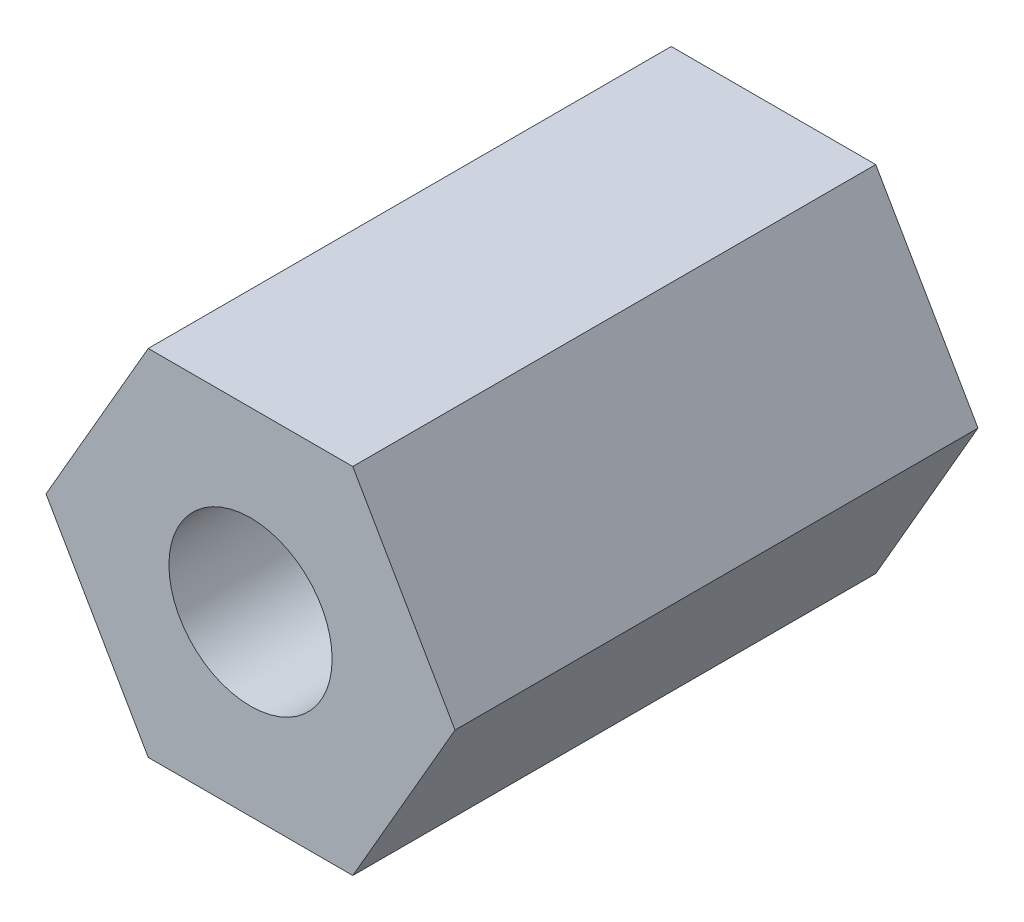
ISO-10303-21;
HEADER;
FILE_DESCRIPTION(('STEP AP214'),'2;1');
FILE_NAME('part.step','',(''),(''),'','','');
FILE_SCHEMA(('AUTOMOTIVE_DESIGN { 1 0 10303 214 1 1 1 1 }'));
ENDSEC;
DATA;
#1=APPLICATION_CONTEXT('core data for automotive mechanical design processes');
#2=APPLICATION_PROTOCOL_DEFINITION('international standard','automotive_design',2000,#1);
#3=PRODUCT_CONTEXT('',#1,'mechanical');
#4=PRODUCT('Part','Part','',(#3));
#5=PRODUCT_RELATED_PRODUCT_CATEGORY('part','',(#4));
#6=PRODUCT_DEFINITION_FORMATION('','',#4);
#7=PRODUCT_DEFINITION_CONTEXT('part definition',#1,'design');
#8=PRODUCT_DEFINITION('design','',#6,#7);
#9=PRODUCT_DEFINITION_SHAPE('','',#8);
#10=(LENGTH_UNIT() NAMED_UNIT(*) SI_UNIT(.MILLI.,.METRE.));
#11=(NAMED_UNIT(*) PLANE_ANGLE_UNIT() SI_UNIT($,.RADIAN.));
#12=(NAMED_UNIT(*) SI_UNIT($,.STERADIAN.) SOLID_ANGLE_UNIT());
#13=UNCERTAINTY_MEASURE_WITH_UNIT(LENGTH_MEASURE(1.E-05),#10,'distance_accuracy_value','');
#14=(GEOMETRIC_REPRESENTATION_CONTEXT(3) GLOBAL_UNCERTAINTY_ASSIGNED_CONTEXT((#13)) GLOBAL_UNIT_ASSIGNED_CONTEXT((#10,
#11,#12)) REPRESENTATION_CONTEXT('',''));
#15=CARTESIAN_POINT('',(0.,0.,0.));
#16=DIRECTION('',(0.,0.,1.));
#17=DIRECTION('',(1.,0.,0.));
#18=AXIS2_PLACEMENT_3D('',#15,#16,#17);
#19=CARTESIAN_POINT('',(0.,0.,-1.01835));
#20=DIRECTION('',(0.,0.,1.));
#21=DIRECTION('',(-1.,0.,0.));
#22=AXIS2_PLACEMENT_3D('',#19,#20,#21);
#23=CYLINDRICAL_SURFACE('',#22,1.025);
#24=CARTESIAN_POINT('',(0.,0.,0.));
#25=DIRECTION('',(0.,0.,1.));
#26=DIRECTION('',(-1.,0.,0.));
#27=AXIS2_PLACEMENT_3D('',#24,#25,#26);
#28=CIRCLE('',#27,1.025);
#29=CARTESIAN_POINT('',(1.025,0.,0.));
#30=VERTEX_POINT('',#29);
#31=EDGE_CURVE('E149',#30,#30,#28,.T.);
#32=ORIENTED_EDGE('',*,*,#31,.F.);
#33=DIRECTION('',(0.,0.,1.));
#34=VECTOR('',#33,1.);
#35=CARTESIAN_POINT('',(1.025,0.,-1.01835));
#36=LINE('',#35,#34);
#37=CARTESIAN_POINT('',(1.025,0.,6.57));
#38=VERTEX_POINT('',#37);
#39=EDGE_CURVE('E11',#30,#38,#36,.T.);
#40=ORIENTED_EDGE('',*,*,#39,.T.);
#41=CARTESIAN_POINT('',(0.,0.,6.57));
#42=DIRECTION('',(0.,0.,1.));
#43=DIRECTION('',(-1.,0.,0.));
#44=AXIS2_PLACEMENT_3D('',#41,#42,#43);
#45=CIRCLE('',#44,1.025);
#46=EDGE_CURVE('E27',#38,#38,#45,.T.);
#47=ORIENTED_EDGE('',*,*,#46,.T.);
#48=ORIENTED_EDGE('',*,*,#39,.F.);
#49=EDGE_LOOP('',(#32,#40,#47,#48));
#50=FACE_BOUND('',#49,.T.);
#51=ADVANCED_FACE('F17',(#50),#23,.F.);
#52=CARTESIAN_POINT('',(0.,0.,6.57));
#53=DIRECTION('',(0.,0.,1.));
#54=DIRECTION('',(1.,0.,0.));
#55=AXIS2_PLACEMENT_3D('',#52,#53,#54);
#56=PLANE('',#55);
#57=ORIENTED_EDGE('',*,*,#46,.F.);
#58=EDGE_LOOP('',(#57));
#59=FACE_BOUND('',#58,.T.);
#60=DIRECTION('',(0.500000000000017,-0.866025403784429,0.));
#61=VECTOR('',#60,1.);
#62=CARTESIAN_POINT('',(-2.569208697894,0.,6.57));
#63=LINE('',#62,#61);
#64=CARTESIAN_POINT('',(-2.569208697894,0.,6.57));
#65=VERTEX_POINT('',#64);
#66=CARTESIAN_POINT('',(-1.284604348947,-2.225,6.57));
#67=VERTEX_POINT('',#66);
#68=EDGE_CURVE('E128',#65,#67,#63,.T.);
#69=ORIENTED_EDGE('',*,*,#68,.T.);
#70=DIRECTION('',(1.,0.,0.));
#71=VECTOR('',#70,1.);
#72=CARTESIAN_POINT('',(-1.284604348947,-2.225,6.57));
#73=LINE('',#72,#71);
#74=CARTESIAN_POINT('',(1.284604348947,-2.225,6.57));
#75=VERTEX_POINT('',#74);
#76=EDGE_CURVE('E96',#67,#75,#73,.T.);
#77=ORIENTED_EDGE('',*,*,#76,.T.);
#78=DIRECTION('',(0.500000000000017,0.866025403784429,0.));
#79=VECTOR('',#78,1.);
#80=CARTESIAN_POINT('',(1.284604348947,-2.225,6.57));
#81=LINE('',#80,#79);
#82=CARTESIAN_POINT('',(2.569208697894,0.,6.57));
#83=VERTEX_POINT('',#82);
#84=EDGE_CURVE('E92',#75,#83,#81,.T.);
#85=ORIENTED_EDGE('',*,*,#84,.T.);
#86=DIRECTION('',(-0.500000000000017,0.866025403784429,0.));
#87=VECTOR('',#86,1.);
#88=CARTESIAN_POINT('',(2.569208697894,0.,6.57));
#89=LINE('',#88,#87);
#90=CARTESIAN_POINT('',(1.284604348947,2.225,6.57));
#91=VERTEX_POINT('',#90);
#92=EDGE_CURVE('E87',#83,#91,#89,.T.);
#93=ORIENTED_EDGE('',*,*,#92,.T.);
#94=DIRECTION('',(-1.,0.,0.));
#95=VECTOR('',#94,1.);
#96=CARTESIAN_POINT('',(1.284604348947,2.225,6.57));
#97=LINE('',#96,#95);
#98=CARTESIAN_POINT('',(-1.284604348947,2.225,6.57));
#99=VERTEX_POINT('',#98);
#100=EDGE_CURVE('E121',#91,#99,#97,.T.);
#101=ORIENTED_EDGE('',*,*,#100,.T.);
#102=DIRECTION('',(-0.500000000000017,-0.866025403784429,0.));
#103=VECTOR('',#102,1.);
#104=CARTESIAN_POINT('',(-1.284604348947,2.225,6.57));
#105=LINE('',#104,#103);
#106=EDGE_CURVE('E20',#99,#65,#105,.T.);
#107=ORIENTED_EDGE('',*,*,#106,.T.);
#108=EDGE_LOOP('',(#69,#77,#85,#93,#101,#107));
#109=FACE_BOUND('',#108,.T.);
#110=ADVANCED_FACE('F95',(#59,#109),#56,.T.);
#111=CARTESIAN_POINT('',(-1.284604348947,-2.225,0.));
#112=DIRECTION('',(0.,-1.,0.));
#113=DIRECTION('',(0.,0.,-1.));
#114=AXIS2_PLACEMENT_3D('',#111,#112,#113);
#115=PLANE('',#114);
#116=DIRECTION('',(1.,0.,0.));
#117=VECTOR('',#116,1.);
#118=CARTESIAN_POINT('',(-1.284604348947,-2.225,0.));
#119=LINE('',#118,#117);
#120=CARTESIAN_POINT('',(-1.284604348947,-2.225,0.));
#121=VERTEX_POINT('',#120);
#122=CARTESIAN_POINT('',(1.284604348947,-2.225,0.));
#123=VERTEX_POINT('',#122);
#124=EDGE_CURVE('E140',#121,#123,#119,.T.);
#125=ORIENTED_EDGE('',*,*,#124,.T.);
#126=DIRECTION('',(0.,0.,1.));
#127=VECTOR('',#126,1.);
#128=CARTESIAN_POINT('',(1.284604348947,-2.225,0.));
#129=LINE('',#128,#127);
#130=EDGE_CURVE('E100',#123,#75,#129,.T.);
#131=ORIENTED_EDGE('',*,*,#130,.T.);
#132=ORIENTED_EDGE('',*,*,#76,.F.);
#133=DIRECTION('',(0.,0.,1.));
#134=VECTOR('',#133,1.);
#135=CARTESIAN_POINT('',(-1.284604348947,-2.225,0.));
#136=LINE('',#135,#134);
#137=EDGE_CURVE('E148',#121,#67,#136,.T.);
#138=ORIENTED_EDGE('',*,*,#137,.F.);
#139=EDGE_LOOP('',(#125,#131,#132,#138));
#140=FACE_BOUND('',#139,.T.);
#141=ADVANCED_FACE('F292',(#140),#115,.T.);
#142=CARTESIAN_POINT('',(1.284604348947,-2.225,0.));
#143=DIRECTION('',(0.866025403784429,-0.500000000000017,0.));
#144=DIRECTION('',(0.,0.,-1.));
#145=AXIS2_PLACEMENT_3D('',#142,#143,#144);
#146=PLANE('',#145);
#147=DIRECTION('',(0.500000000000017,0.866025403784429,0.));
#148=VECTOR('',#147,1.);
#149=CARTESIAN_POINT('',(1.284604348947,-2.225,0.));
#150=LINE('',#149,#148);
#151=CARTESIAN_POINT('',(2.569208697894,0.,0.));
#152=VERTEX_POINT('',#151);
#153=EDGE_CURVE('E106',#123,#152,#150,.T.);
#154=ORIENTED_EDGE('',*,*,#153,.T.);
#155=DIRECTION('',(0.,0.,1.));
#156=VECTOR('',#155,1.);
#157=CARTESIAN_POINT('',(2.569208697894,0.,0.));
#158=LINE('',#157,#156);
#159=EDGE_CURVE('E101',#152,#83,#158,.T.);
#160=ORIENTED_EDGE('',*,*,#159,.T.);
#161=ORIENTED_EDGE('',*,*,#84,.F.);
#162=ORIENTED_EDGE('',*,*,#130,.F.);
#163=EDGE_LOOP('',(#154,#160,#161,#162));
#164=FACE_BOUND('',#163,.T.);
#165=ADVANCED_FACE('F104',(#164),#146,.T.);
#166=CARTESIAN_POINT('',(2.569208697894,0.,0.));
#167=DIRECTION('',(0.866025403784429,0.500000000000017,0.));
#168=DIRECTION('',(0.,0.,-1.));
#169=AXIS2_PLACEMENT_3D('',#166,#167,#168);
#170=PLANE('',#169);
#171=DIRECTION('',(-0.500000000000017,0.866025403784429,0.));
#172=VECTOR('',#171,1.);
#173=CARTESIAN_POINT('',(2.569208697894,0.,0.));
#174=LINE('',#173,#172);
#175=CARTESIAN_POINT('',(1.284604348947,2.225,0.));
#176=VERTEX_POINT('',#175);
#177=EDGE_CURVE('E141',#152,#176,#174,.T.);
#178=ORIENTED_EDGE('',*,*,#177,.T.);
#179=DIRECTION('',(0.,0.,1.));
#180=VECTOR('',#179,1.);
#181=CARTESIAN_POINT('',(1.284604348947,2.225,0.));
#182=LINE('',#181,#180);
#183=EDGE_CURVE('E114',#176,#91,#182,.T.);
#184=ORIENTED_EDGE('',*,*,#183,.T.);
#185=ORIENTED_EDGE('',*,*,#92,.F.);
#186=ORIENTED_EDGE('',*,*,#159,.F.);
#187=EDGE_LOOP('',(#178,#184,#185,#186));
#188=FACE_BOUND('',#187,.T.);
#189=ADVANCED_FACE('F112',(#188),#170,.T.);
#190=CARTESIAN_POINT('',(1.284604348947,2.225,0.));
#191=DIRECTION('',(0.,1.,0.));
#192=DIRECTION('',(1.,0.,0.));
#193=AXIS2_PLACEMENT_3D('',#190,#191,#192);
#194=PLANE('',#193);
#195=DIRECTION('',(-1.,0.,0.));
#196=VECTOR('',#195,1.);
#197=CARTESIAN_POINT('',(1.284604348947,2.225,0.));
#198=LINE('',#197,#196);
#199=CARTESIAN_POINT('',(-1.284604348947,2.225,0.));
#200=VERTEX_POINT('',#199);
#201=EDGE_CURVE('E156',#176,#200,#198,.T.);
#202=ORIENTED_EDGE('',*,*,#201,.T.);
#203=DIRECTION('',(0.,0.,1.));
#204=VECTOR('',#203,1.);
#205=CARTESIAN_POINT('',(-1.284604348947,2.225,0.));
#206=LINE('',#205,#204);
#207=EDGE_CURVE('E142',#200,#99,#206,.T.);
#208=ORIENTED_EDGE('',*,*,#207,.T.);
#209=ORIENTED_EDGE('',*,*,#100,.F.);
#210=ORIENTED_EDGE('',*,*,#183,.F.);
#211=EDGE_LOOP('',(#202,#208,#209,#210));
#212=FACE_BOUND('',#211,.T.);
#213=ADVANCED_FACE('F175',(#212),#194,.T.);
#214=CARTESIAN_POINT('',(-1.284604348947,2.225,0.));
#215=DIRECTION('',(-0.866025403784429,0.500000000000017,0.));
#216=DIRECTION('',(0.,0.,1.));
#217=AXIS2_PLACEMENT_3D('',#214,#215,#216);
#218=PLANE('',#217);
#219=DIRECTION('',(-0.500000000000017,-0.866025403784429,0.));
#220=VECTOR('',#219,1.);
#221=CARTESIAN_POINT('',(-1.284604348947,2.225,0.));
#222=LINE('',#221,#220);
#223=CARTESIAN_POINT('',(-2.569208697894,0.,0.));
#224=VERTEX_POINT('',#223);
#225=EDGE_CURVE('E133',#200,#224,#222,.T.);
#226=ORIENTED_EDGE('',*,*,#225,.T.);
#227=DIRECTION('',(0.,0.,1.));
#228=VECTOR('',#227,1.);
#229=CARTESIAN_POINT('',(-2.569208697894,0.,0.));
#230=LINE('',#229,#228);
#231=EDGE_CURVE('E124',#224,#65,#230,.T.);
#232=ORIENTED_EDGE('',*,*,#231,.T.);
#233=ORIENTED_EDGE('',*,*,#106,.F.);
#234=ORIENTED_EDGE('',*,*,#207,.F.);
#235=EDGE_LOOP('',(#226,#232,#233,#234));
#236=FACE_BOUND('',#235,.T.);
#237=ADVANCED_FACE('F179',(#236),#218,.T.);
#238=CARTESIAN_POINT('',(-2.569208697894,0.,0.));
#239=DIRECTION('',(-0.866025403784429,-0.500000000000017,0.));
#240=DIRECTION('',(-0.500000000000017,0.866025403784429,0.));
#241=AXIS2_PLACEMENT_3D('',#238,#239,#240);
#242=PLANE('',#241);
#243=DIRECTION('',(0.500000000000017,-0.866025403784429,0.));
#244=VECTOR('',#243,1.);
#245=CARTESIAN_POINT('',(-2.569208697894,0.,0.));
#246=LINE('',#245,#244);
#247=EDGE_CURVE('E129',#224,#121,#246,.T.);
#248=ORIENTED_EDGE('',*,*,#247,.T.);
#249=ORIENTED_EDGE('',*,*,#137,.T.);
#250=ORIENTED_EDGE('',*,*,#68,.F.);
#251=ORIENTED_EDGE('',*,*,#231,.F.);
#252=EDGE_LOOP('',(#248,#249,#250,#251));
#253=FACE_BOUND('',#252,.T.);
#254=ADVANCED_FACE('F247',(#253),#242,.T.);
#255=CARTESIAN_POINT('',(0.,0.,0.));
#256=DIRECTION('',(0.,0.,1.));
#257=DIRECTION('',(1.,0.,0.));
#258=AXIS2_PLACEMENT_3D('',#255,#256,#257);
#259=PLANE('',#258);
#260=ORIENTED_EDGE('',*,*,#31,.T.);
#261=EDGE_LOOP('',(#260));
#262=FACE_BOUND('',#261,.T.);
#263=ORIENTED_EDGE('',*,*,#247,.F.);
#264=ORIENTED_EDGE('',*,*,#225,.F.);
#265=ORIENTED_EDGE('',*,*,#201,.F.);
#266=ORIENTED_EDGE('',*,*,#177,.F.);
#267=ORIENTED_EDGE('',*,*,#153,.F.);
#268=ORIENTED_EDGE('',*,*,#124,.F.);
#269=EDGE_LOOP('',(#263,#264,#265,#266,#267,#268));
#270=FACE_BOUND('',#269,.T.);
#271=ADVANCED_FACE('F242',(#262,#270),#259,.F.);
#272=CLOSED_SHELL('',(#51,#110,#141,#165,#189,#213,#237,#254,#271));
#273=MANIFOLD_SOLID_BREP('B1',#272);
#274=ADVANCED_BREP_SHAPE_REPRESENTATION('',(#18,#273),#14);
#275=SHAPE_DEFINITION_REPRESENTATION(#9,#274);
ENDSEC;
END-ISO-10303-21;
